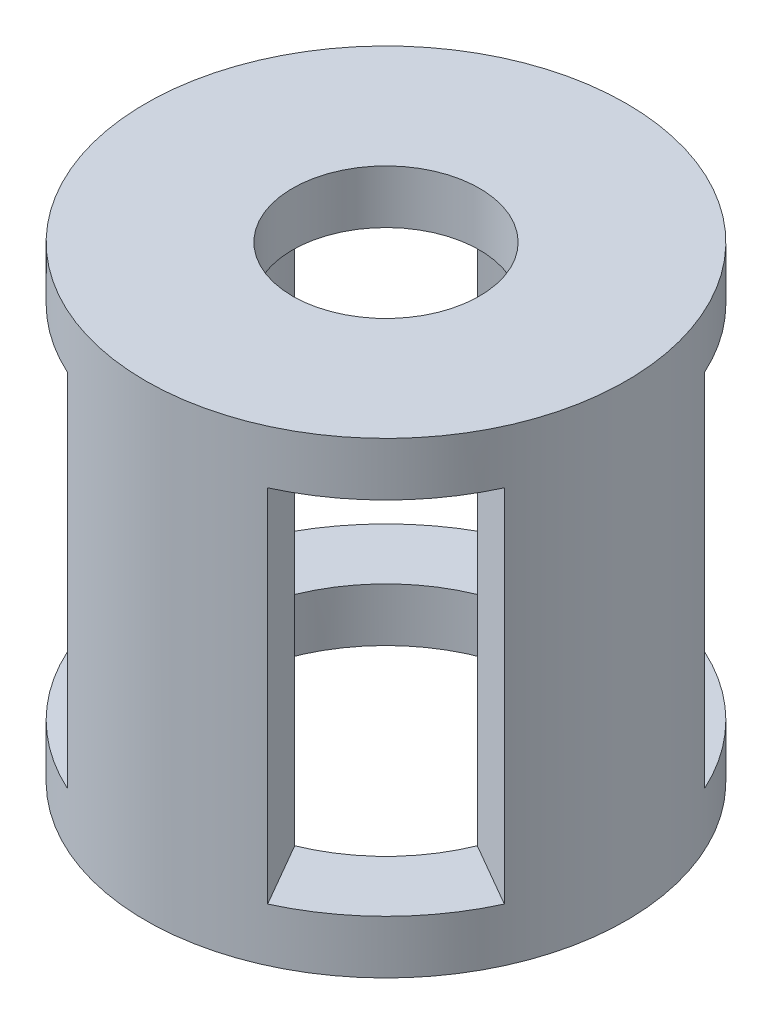
ISO-10303-21;
HEADER;
FILE_DESCRIPTION(('STEP AP214'),'2;1');
FILE_NAME('part.step','',(''),(''),'','','');
FILE_SCHEMA(('AUTOMOTIVE_DESIGN { 1 0 10303 214 1 1 1 1 }'));
ENDSEC;
DATA;
#1=APPLICATION_CONTEXT('core data for automotive mechanical design processes');
#2=APPLICATION_PROTOCOL_DEFINITION('international standard','automotive_design',2000,#1);
#3=PRODUCT_CONTEXT('',#1,'mechanical');
#4=PRODUCT('Part','Part','',(#3));
#5=PRODUCT_RELATED_PRODUCT_CATEGORY('part','',(#4));
#6=PRODUCT_DEFINITION_FORMATION('','',#4);
#7=PRODUCT_DEFINITION_CONTEXT('part definition',#1,'design');
#8=PRODUCT_DEFINITION('design','',#6,#7);
#9=PRODUCT_DEFINITION_SHAPE('','',#8);
#10=(LENGTH_UNIT() NAMED_UNIT(*) SI_UNIT(.MILLI.,.METRE.));
#11=(NAMED_UNIT(*) PLANE_ANGLE_UNIT() SI_UNIT($,.RADIAN.));
#12=(NAMED_UNIT(*) SI_UNIT($,.STERADIAN.) SOLID_ANGLE_UNIT());
#13=UNCERTAINTY_MEASURE_WITH_UNIT(LENGTH_MEASURE(1.E-05),#10,'distance_accuracy_value','');
#14=(GEOMETRIC_REPRESENTATION_CONTEXT(3) GLOBAL_UNCERTAINTY_ASSIGNED_CONTEXT((#13)) GLOBAL_UNIT_ASSIGNED_CONTEXT((#10,
#11,#12)) REPRESENTATION_CONTEXT('',''));
#15=CARTESIAN_POINT('',(0.,0.,0.));
#16=DIRECTION('',(0.,0.,1.));
#17=DIRECTION('',(1.,0.,0.));
#18=AXIS2_PLACEMENT_3D('',#15,#16,#17);
#19=CARTESIAN_POINT('',(4.73244738359085,-30.,11.5695264277128));
#20=DIRECTION('',(-0.866025403784438,0.,0.500000000000001));
#21=DIRECTION('',(0.500000000000001,0.,0.866025403784438));
#22=AXIS2_PLACEMENT_3D('',#19,#20,#21);
#23=PLANE('',#22);
#24=DIRECTION('',(0.500000000000001,0.,0.866025403784438));
#25=VECTOR('',#24,1.);
#26=CARTESIAN_POINT('',(4.73244738359085,-27.,11.5695264277128));
#27=LINE('',#26,#25);
#28=CARTESIAN_POINT('',(4.73244738359085,-27.,11.5695264277128));
#29=VERTEX_POINT('',#28);
#30=CARTESIAN_POINT('',(7.5,-27.,16.3630681719536));
#31=VERTEX_POINT('',#30);
#32=EDGE_CURVE('E48',#29,#31,#27,.T.);
#33=ORIENTED_EDGE('',*,*,#32,.F.);
#34=DIRECTION('',(0.,1.,0.));
#35=VECTOR('',#34,1.);
#36=CARTESIAN_POINT('',(4.73244738359085,-30.,11.5695264277128));
#37=LINE('',#36,#35);
#38=CARTESIAN_POINT('',(4.73244738359085,0.,11.5695264277128));
#39=VERTEX_POINT('',#38);
#40=EDGE_CURVE('E227',#29,#39,#37,.T.);
#41=ORIENTED_EDGE('',*,*,#40,.T.);
#42=DIRECTION('',(0.500000000000001,0.,0.866025403784438));
#43=VECTOR('',#42,1.);
#44=CARTESIAN_POINT('',(4.73244738359085,0.,11.5695264277128));
#45=LINE('',#44,#43);
#46=CARTESIAN_POINT('',(7.5,0.,16.3630681719536));
#47=VERTEX_POINT('',#46);
#48=EDGE_CURVE('E217',#39,#47,#45,.T.);
#49=ORIENTED_EDGE('',*,*,#48,.T.);
#50=DIRECTION('',(0.,1.,0.));
#51=VECTOR('',#50,1.);
#52=CARTESIAN_POINT('',(7.5,-30.,16.3630681719536));
#53=LINE('',#52,#51);
#54=EDGE_CURVE('E53',#31,#47,#53,.T.);
#55=ORIENTED_EDGE('',*,*,#54,.F.);
#56=EDGE_LOOP('',(#33,#41,#49,#55));
#57=FACE_BOUND('',#56,.T.);
#58=ADVANCED_FACE('F33',(#57),#23,.F.);
#59=CARTESIAN_POINT('',(-4.73244738359085,-30.,11.5695264277128));
#60=DIRECTION('',(0.866025403784438,0.,0.500000000000001));
#61=DIRECTION('',(0.500000000000001,0.,-0.866025403784438));
#62=AXIS2_PLACEMENT_3D('',#59,#60,#61);
#63=PLANE('',#62);
#64=DIRECTION('',(0.500000000000001,0.,-0.866025403784438));
#65=VECTOR('',#64,1.);
#66=CARTESIAN_POINT('',(-4.73244738359085,-27.,11.5695264277128));
#67=LINE('',#66,#65);
#68=CARTESIAN_POINT('',(-7.49999999999999,-27.,16.3630681719536));
#69=VERTEX_POINT('',#68);
#70=CARTESIAN_POINT('',(-4.73244738359085,-27.,11.5695264277128));
#71=VERTEX_POINT('',#70);
#72=EDGE_CURVE('E309',#69,#71,#67,.T.);
#73=ORIENTED_EDGE('',*,*,#72,.F.);
#74=DIRECTION('',(0.,1.,0.));
#75=VECTOR('',#74,1.);
#76=CARTESIAN_POINT('',(-7.49999999999999,-30.,16.3630681719536));
#77=LINE('',#76,#75);
#78=CARTESIAN_POINT('',(-7.5,0.,16.3630681719536));
#79=VERTEX_POINT('',#78);
#80=EDGE_CURVE('E224',#69,#79,#77,.T.);
#81=ORIENTED_EDGE('',*,*,#80,.T.);
#82=DIRECTION('',(0.500000000000001,0.,-0.866025403784438));
#83=VECTOR('',#82,1.);
#84=CARTESIAN_POINT('',(-4.73244738359085,0.,11.5695264277128));
#85=LINE('',#84,#83);
#86=CARTESIAN_POINT('',(-4.73244738359085,0.,11.5695264277128));
#87=VERTEX_POINT('',#86);
#88=EDGE_CURVE('E219',#79,#87,#85,.T.);
#89=ORIENTED_EDGE('',*,*,#88,.T.);
#90=DIRECTION('',(0.,1.,0.));
#91=VECTOR('',#90,1.);
#92=CARTESIAN_POINT('',(-4.73244738359085,-30.,11.5695264277128));
#93=LINE('',#92,#91);
#94=EDGE_CURVE('E222',#71,#87,#93,.T.);
#95=ORIENTED_EDGE('',*,*,#94,.F.);
#96=EDGE_LOOP('',(#73,#81,#89,#95));
#97=FACE_BOUND('',#96,.T.);
#98=ADVANCED_FACE('F315',(#97),#63,.F.);
#99=CARTESIAN_POINT('',(11.5695264277127,-30.,-4.7324473835909));
#100=DIRECTION('',(0.500000000000004,0.,0.866025403784436));
#101=DIRECTION('',(0.866025403784436,0.,-0.500000000000004));
#102=AXIS2_PLACEMENT_3D('',#99,#100,#101);
#103=PLANE('',#102);
#104=DIRECTION('',(0.866025403784436,0.,-0.500000000000004));
#105=VECTOR('',#104,1.);
#106=CARTESIAN_POINT('',(11.5695264277127,-27.,-4.7324473835909));
#107=LINE('',#106,#105);
#108=CARTESIAN_POINT('',(11.5695264277127,-27.,-4.7324473835909));
#109=VERTEX_POINT('',#108);
#110=CARTESIAN_POINT('',(16.3630681719535,-27.,-7.50000000000006));
#111=VERTEX_POINT('',#110);
#112=EDGE_CURVE('E307',#109,#111,#107,.T.);
#113=ORIENTED_EDGE('',*,*,#112,.F.);
#114=DIRECTION('',(0.,1.,0.));
#115=VECTOR('',#114,1.);
#116=CARTESIAN_POINT('',(11.5695264277127,-30.,-4.7324473835909));
#117=LINE('',#116,#115);
#118=CARTESIAN_POINT('',(11.5695264277127,0.,-4.7324473835909));
#119=VERTEX_POINT('',#118);
#120=EDGE_CURVE('E212',#109,#119,#117,.T.);
#121=ORIENTED_EDGE('',*,*,#120,.T.);
#122=DIRECTION('',(0.866025403784436,0.,-0.500000000000004));
#123=VECTOR('',#122,1.);
#124=CARTESIAN_POINT('',(11.5695264277127,0.,-4.7324473835909));
#125=LINE('',#124,#123);
#126=CARTESIAN_POINT('',(16.3630681719535,0.,-7.50000000000006));
#127=VERTEX_POINT('',#126);
#128=EDGE_CURVE('E200',#119,#127,#125,.T.);
#129=ORIENTED_EDGE('',*,*,#128,.T.);
#130=DIRECTION('',(0.,1.,0.));
#131=VECTOR('',#130,1.);
#132=CARTESIAN_POINT('',(16.3630681719535,-30.,-7.50000000000006));
#133=LINE('',#132,#131);
#134=EDGE_CURVE('E210',#111,#127,#133,.T.);
#135=ORIENTED_EDGE('',*,*,#134,.F.);
#136=EDGE_LOOP('',(#113,#121,#129,#135));
#137=FACE_BOUND('',#136,.T.);
#138=ADVANCED_FACE('F335',(#137),#103,.F.);
#139=CARTESIAN_POINT('',(11.5695264277128,-30.,4.73244738359081));
#140=DIRECTION('',(0.499999999999998,0.,-0.86602540378444));
#141=DIRECTION('',(-0.86602540378444,0.,-0.499999999999998));
#142=AXIS2_PLACEMENT_3D('',#139,#140,#141);
#143=PLANE('',#142);
#144=DIRECTION('',(-0.86602540378444,0.,-0.499999999999998));
#145=VECTOR('',#144,1.);
#146=CARTESIAN_POINT('',(11.5695264277128,-27.,4.73244738359081));
#147=LINE('',#146,#145);
#148=CARTESIAN_POINT('',(16.3630681719536,-27.,7.49999999999994));
#149=VERTEX_POINT('',#148);
#150=CARTESIAN_POINT('',(11.5695264277128,-27.,4.73244738359081));
#151=VERTEX_POINT('',#150);
#152=EDGE_CURVE('E283',#149,#151,#147,.T.);
#153=ORIENTED_EDGE('',*,*,#152,.F.);
#154=DIRECTION('',(0.,1.,0.));
#155=VECTOR('',#154,1.);
#156=CARTESIAN_POINT('',(16.3630681719536,-30.,7.49999999999994));
#157=LINE('',#156,#155);
#158=CARTESIAN_POINT('',(16.3630681719536,0.,7.49999999999994));
#159=VERTEX_POINT('',#158);
#160=EDGE_CURVE('E208',#149,#159,#157,.T.);
#161=ORIENTED_EDGE('',*,*,#160,.T.);
#162=DIRECTION('',(-0.86602540378444,0.,-0.499999999999998));
#163=VECTOR('',#162,1.);
#164=CARTESIAN_POINT('',(11.5695264277128,0.,4.73244738359081));
#165=LINE('',#164,#163);
#166=CARTESIAN_POINT('',(11.5695264277128,0.,4.73244738359081));
#167=VERTEX_POINT('',#166);
#168=EDGE_CURVE('E203',#159,#167,#165,.T.);
#169=ORIENTED_EDGE('',*,*,#168,.T.);
#170=DIRECTION('',(0.,1.,0.));
#171=VECTOR('',#170,1.);
#172=CARTESIAN_POINT('',(11.5695264277128,-30.,4.73244738359081));
#173=LINE('',#172,#171);
#174=EDGE_CURVE('E206',#151,#167,#173,.T.);
#175=ORIENTED_EDGE('',*,*,#174,.F.);
#176=EDGE_LOOP('',(#153,#161,#169,#175));
#177=FACE_BOUND('',#176,.T.);
#178=ADVANCED_FACE('F290',(#177),#143,.F.);
#179=CARTESIAN_POINT('',(-4.73244738359094,-30.,-11.5695264277127));
#180=DIRECTION('',(0.866025403784434,0.,-0.500000000000007));
#181=DIRECTION('',(-0.500000000000007,0.,-0.866025403784434));
#182=AXIS2_PLACEMENT_3D('',#179,#180,#181);
#183=PLANE('',#182);
#184=DIRECTION('',(-0.500000000000007,0.,-0.866025403784434));
#185=VECTOR('',#184,1.);
#186=CARTESIAN_POINT('',(-4.73244738359094,-27.,-11.5695264277127));
#187=LINE('',#186,#185);
#188=CARTESIAN_POINT('',(-4.73244738359094,-27.,-11.5695264277127));
#189=VERTEX_POINT('',#188);
#190=CARTESIAN_POINT('',(-7.50000000000012,-27.,-16.3630681719535));
#191=VERTEX_POINT('',#190);
#192=EDGE_CURVE('E304',#189,#191,#187,.T.);
#193=ORIENTED_EDGE('',*,*,#192,.F.);
#194=DIRECTION('',(0.,1.,0.));
#195=VECTOR('',#194,1.);
#196=CARTESIAN_POINT('',(-4.73244738359094,-30.,-11.5695264277127));
#197=LINE('',#196,#195);
#198=CARTESIAN_POINT('',(-4.73244738359094,0.,-11.5695264277127));
#199=VERTEX_POINT('',#198);
#200=EDGE_CURVE('E195',#189,#199,#197,.T.);
#201=ORIENTED_EDGE('',*,*,#200,.T.);
#202=DIRECTION('',(-0.500000000000007,0.,-0.866025403784435));
#203=VECTOR('',#202,1.);
#204=CARTESIAN_POINT('',(-4.73244738359094,0.,-11.5695264277127));
#205=LINE('',#204,#203);
#206=CARTESIAN_POINT('',(-7.50000000000012,0.,-16.3630681719535));
#207=VERTEX_POINT('',#206);
#208=EDGE_CURVE('E183',#199,#207,#205,.T.);
#209=ORIENTED_EDGE('',*,*,#208,.T.);
#210=DIRECTION('',(0.,1.,0.));
#211=VECTOR('',#210,1.);
#212=CARTESIAN_POINT('',(-7.50000000000012,-30.,-16.3630681719535));
#213=LINE('',#212,#211);
#214=EDGE_CURVE('E193',#191,#207,#213,.T.);
#215=ORIENTED_EDGE('',*,*,#214,.F.);
#216=EDGE_LOOP('',(#193,#201,#209,#215));
#217=FACE_BOUND('',#216,.T.);
#218=ADVANCED_FACE('F357',(#217),#183,.F.);
#219=CARTESIAN_POINT('',(4.73244738359077,-30.,-11.5695264277128));
#220=DIRECTION('',(-0.866025403784441,0.,-0.499999999999995));
#221=DIRECTION('',(-0.499999999999995,0.,0.866025403784441));
#222=AXIS2_PLACEMENT_3D('',#219,#220,#221);
#223=PLANE('',#222);
#224=DIRECTION('',(-0.499999999999995,0.,0.866025403784441));
#225=VECTOR('',#224,1.);
#226=CARTESIAN_POINT('',(4.73244738359077,-27.,-11.5695264277128));
#227=LINE('',#226,#225);
#228=CARTESIAN_POINT('',(7.49999999999988,-27.,-16.3630681719536));
#229=VERTEX_POINT('',#228);
#230=CARTESIAN_POINT('',(4.73244738359077,-27.,-11.5695264277128));
#231=VERTEX_POINT('',#230);
#232=EDGE_CURVE('E302',#229,#231,#227,.T.);
#233=ORIENTED_EDGE('',*,*,#232,.F.);
#234=DIRECTION('',(0.,1.,0.));
#235=VECTOR('',#234,1.);
#236=CARTESIAN_POINT('',(7.49999999999988,-30.,-16.3630681719536));
#237=LINE('',#236,#235);
#238=CARTESIAN_POINT('',(7.49999999999988,0.,-16.3630681719536));
#239=VERTEX_POINT('',#238);
#240=EDGE_CURVE('E191',#229,#239,#237,.T.);
#241=ORIENTED_EDGE('',*,*,#240,.T.);
#242=DIRECTION('',(-0.499999999999995,0.,0.866025403784441));
#243=VECTOR('',#242,1.);
#244=CARTESIAN_POINT('',(4.73244738359077,0.,-11.5695264277128));
#245=LINE('',#244,#243);
#246=CARTESIAN_POINT('',(4.73244738359077,0.,-11.5695264277128));
#247=VERTEX_POINT('',#246);
#248=EDGE_CURVE('E186',#239,#247,#245,.T.);
#249=ORIENTED_EDGE('',*,*,#248,.T.);
#250=DIRECTION('',(0.,1.,0.));
#251=VECTOR('',#250,1.);
#252=CARTESIAN_POINT('',(4.73244738359077,-30.,-11.5695264277128));
#253=LINE('',#252,#251);
#254=EDGE_CURVE('E189',#231,#247,#253,.T.);
#255=ORIENTED_EDGE('',*,*,#254,.F.);
#256=EDGE_LOOP('',(#233,#241,#249,#255));
#257=FACE_BOUND('',#256,.T.);
#258=ADVANCED_FACE('F349',(#257),#223,.F.);
#259=CARTESIAN_POINT('',(-11.5695264277127,-30.,4.73244738359097));
#260=DIRECTION('',(-0.50000000000001,0.,-0.866025403784433));
#261=DIRECTION('',(-0.866025403784433,0.,0.50000000000001));
#262=AXIS2_PLACEMENT_3D('',#259,#260,#261);
#263=PLANE('',#262);
#264=DIRECTION('',(-0.866025403784433,0.,0.50000000000001));
#265=VECTOR('',#264,1.);
#266=CARTESIAN_POINT('',(-11.5695264277127,-27.,4.73244738359097));
#267=LINE('',#266,#265);
#268=CARTESIAN_POINT('',(-11.5695264277127,-27.,4.73244738359097));
#269=VERTEX_POINT('',#268);
#270=CARTESIAN_POINT('',(-16.3630681719535,-27.,7.50000000000017));
#271=VERTEX_POINT('',#270);
#272=EDGE_CURVE('E151',#269,#271,#267,.T.);
#273=ORIENTED_EDGE('',*,*,#272,.F.);
#274=DIRECTION('',(0.,1.,0.));
#275=VECTOR('',#274,1.);
#276=CARTESIAN_POINT('',(-11.5695264277127,-30.,4.73244738359097));
#277=LINE('',#276,#275);
#278=CARTESIAN_POINT('',(-11.5695264277127,0.,4.73244738359097));
#279=VERTEX_POINT('',#278);
#280=EDGE_CURVE('E144',#269,#279,#277,.T.);
#281=ORIENTED_EDGE('',*,*,#280,.T.);
#282=DIRECTION('',(-0.866025403784433,0.,0.50000000000001));
#283=VECTOR('',#282,1.);
#284=CARTESIAN_POINT('',(-11.5695264277127,0.,4.73244738359097));
#285=LINE('',#284,#283);
#286=CARTESIAN_POINT('',(-16.3630681719535,0.,7.50000000000017));
#287=VERTEX_POINT('',#286);
#288=EDGE_CURVE('E148',#279,#287,#285,.T.);
#289=ORIENTED_EDGE('',*,*,#288,.T.);
#290=DIRECTION('',(0.,1.,0.));
#291=VECTOR('',#290,1.);
#292=CARTESIAN_POINT('',(-16.3630681719535,-30.,7.50000000000017));
#293=LINE('',#292,#291);
#294=EDGE_CURVE('E156',#271,#287,#293,.T.);
#295=ORIENTED_EDGE('',*,*,#294,.F.);
#296=EDGE_LOOP('',(#273,#281,#289,#295));
#297=FACE_BOUND('',#296,.T.);
#298=ADVANCED_FACE('F146',(#297),#263,.F.);
#299=CARTESIAN_POINT('',(-11.5695264277128,-30.,-4.73244738359074));
#300=DIRECTION('',(-0.499999999999992,0.,0.866025403784443));
#301=DIRECTION('',(0.866025403784443,0.,0.499999999999992));
#302=AXIS2_PLACEMENT_3D('',#299,#300,#301);
#303=PLANE('',#302);
#304=DIRECTION('',(0.866025403784443,0.,0.499999999999992));
#305=VECTOR('',#304,1.);
#306=CARTESIAN_POINT('',(-11.5695264277128,-27.,-4.73244738359074));
#307=LINE('',#306,#305);
#308=CARTESIAN_POINT('',(-16.3630681719537,-27.,-7.49999999999982));
#309=VERTEX_POINT('',#308);
#310=CARTESIAN_POINT('',(-11.5695264277128,-27.,-4.73244738359074));
#311=VERTEX_POINT('',#310);
#312=EDGE_CURVE('E11',#309,#311,#307,.T.);
#313=ORIENTED_EDGE('',*,*,#312,.F.);
#314=DIRECTION('',(0.,1.,0.));
#315=VECTOR('',#314,1.);
#316=CARTESIAN_POINT('',(-16.3630681719537,-30.,-7.49999999999982));
#317=LINE('',#316,#315);
#318=CARTESIAN_POINT('',(-16.3630681719537,0.,-7.49999999999982));
#319=VERTEX_POINT('',#318);
#320=EDGE_CURVE('E178',#309,#319,#317,.T.);
#321=ORIENTED_EDGE('',*,*,#320,.T.);
#322=DIRECTION('',(0.866025403784443,0.,0.499999999999992));
#323=VECTOR('',#322,1.);
#324=CARTESIAN_POINT('',(-11.5695264277128,0.,-4.73244738359074));
#325=LINE('',#324,#323);
#326=CARTESIAN_POINT('',(-11.5695264277128,0.,-4.73244738359074));
#327=VERTEX_POINT('',#326);
#328=EDGE_CURVE('E172',#319,#327,#325,.T.);
#329=ORIENTED_EDGE('',*,*,#328,.T.);
#330=DIRECTION('',(0.,1.,0.));
#331=VECTOR('',#330,1.);
#332=CARTESIAN_POINT('',(-11.5695264277128,-30.,-4.73244738359074));
#333=LINE('',#332,#331);
#334=EDGE_CURVE('E163',#311,#327,#333,.T.);
#335=ORIENTED_EDGE('',*,*,#334,.F.);
#336=EDGE_LOOP('',(#313,#321,#329,#335));
#337=FACE_BOUND('',#336,.T.);
#338=ADVANCED_FACE('F256',(#337),#303,.F.);
#339=CARTESIAN_POINT('',(0.,0.,0.));
#340=DIRECTION('',(0.,1.,0.));
#341=DIRECTION('',(0.,0.,1.));
#342=AXIS2_PLACEMENT_3D('',#339,#340,#341);
#343=PLANE('',#342);
#344=CARTESIAN_POINT('',(0.,0.,0.));
#345=DIRECTION('',(0.,1.,0.));
#346=DIRECTION('',(0.,0.,1.));
#347=AXIS2_PLACEMENT_3D('',#344,#345,#346);
#348=CIRCLE('',#347,7.);
#349=CARTESIAN_POINT('',(0.,0.,7.));
#350=VERTEX_POINT('',#349);
#351=EDGE_CURVE('E229',#350,#350,#348,.T.);
#352=ORIENTED_EDGE('',*,*,#351,.T.);
#353=EDGE_LOOP('',(#352));
#354=FACE_BOUND('',#353,.T.);
#355=ORIENTED_EDGE('',*,*,#288,.F.);
#356=CARTESIAN_POINT('',(0.,0.,0.));
#357=DIRECTION('',(0.,1.,0.));
#358=DIRECTION('',(0.,0.,-1.));
#359=AXIS2_PLACEMENT_3D('',#356,#357,#358);
#360=CIRCLE('',#359,12.5);
#361=EDGE_CURVE('E159',#327,#279,#360,.T.);
#362=ORIENTED_EDGE('',*,*,#361,.F.);
#363=ORIENTED_EDGE('',*,*,#328,.F.);
#364=CARTESIAN_POINT('',(0.,0.,0.));
#365=DIRECTION('',(0.,1.,0.));
#366=DIRECTION('',(0.,0.,1.));
#367=AXIS2_PLACEMENT_3D('',#364,#365,#366);
#368=CIRCLE('',#367,18.);
#369=EDGE_CURVE('E243',#207,#319,#368,.T.);
#370=ORIENTED_EDGE('',*,*,#369,.F.);
#371=ORIENTED_EDGE('',*,*,#208,.F.);
#372=CARTESIAN_POINT('',(0.,0.,0.));
#373=DIRECTION('',(0.,1.,0.));
#374=DIRECTION('',(0.,0.,-1.));
#375=AXIS2_PLACEMENT_3D('',#372,#373,#374);
#376=CIRCLE('',#375,12.5);
#377=EDGE_CURVE('E155',#247,#199,#376,.T.);
#378=ORIENTED_EDGE('',*,*,#377,.F.);
#379=ORIENTED_EDGE('',*,*,#248,.F.);
#380=EDGE_CURVE('E238',#127,#239,#368,.T.);
#381=ORIENTED_EDGE('',*,*,#380,.F.);
#382=ORIENTED_EDGE('',*,*,#128,.F.);
#383=CARTESIAN_POINT('',(0.,0.,0.));
#384=DIRECTION('',(0.,1.,0.));
#385=DIRECTION('',(0.,0.,-1.));
#386=AXIS2_PLACEMENT_3D('',#383,#384,#385);
#387=CIRCLE('',#386,12.5);
#388=EDGE_CURVE('E197',#167,#119,#387,.T.);
#389=ORIENTED_EDGE('',*,*,#388,.F.);
#390=ORIENTED_EDGE('',*,*,#168,.F.);
#391=EDGE_CURVE('E236',#47,#159,#368,.T.);
#392=ORIENTED_EDGE('',*,*,#391,.F.);
#393=ORIENTED_EDGE('',*,*,#48,.F.);
#394=CARTESIAN_POINT('',(0.,0.,0.));
#395=DIRECTION('',(0.,1.,0.));
#396=DIRECTION('',(0.,0.,-1.));
#397=AXIS2_PLACEMENT_3D('',#394,#395,#396);
#398=CIRCLE('',#397,12.5);
#399=EDGE_CURVE('E214',#87,#39,#398,.T.);
#400=ORIENTED_EDGE('',*,*,#399,.F.);
#401=ORIENTED_EDGE('',*,*,#88,.F.);
#402=EDGE_CURVE('E171',#287,#79,#368,.T.);
#403=ORIENTED_EDGE('',*,*,#402,.F.);
#404=EDGE_LOOP('',(#355,#362,#363,#370,#371,#378,#379,#381,#382,#389,#390,#392,#393,#400,#401,#403));
#405=FACE_BOUND('',#404,.T.);
#406=ADVANCED_FACE('F168',(#354,#405),#343,.F.);
#407=CARTESIAN_POINT('',(0.,4.,0.));
#408=DIRECTION('',(0.,1.,0.));
#409=DIRECTION('',(0.,0.,1.));
#410=AXIS2_PLACEMENT_3D('',#407,#408,#409);
#411=PLANE('',#410);
#412=CARTESIAN_POINT('',(0.,4.,0.));
#413=DIRECTION('',(0.,1.,0.));
#414=DIRECTION('',(0.,0.,1.));
#415=AXIS2_PLACEMENT_3D('',#412,#413,#414);
#416=CIRCLE('',#415,18.);
#417=CARTESIAN_POINT('',(0.,4.,18.));
#418=VERTEX_POINT('',#417);
#419=EDGE_CURVE('E41',#418,#418,#416,.T.);
#420=ORIENTED_EDGE('',*,*,#419,.T.);
#421=EDGE_LOOP('',(#420));
#422=FACE_BOUND('',#421,.T.);
#423=CARTESIAN_POINT('',(0.,4.,0.));
#424=DIRECTION('',(0.,1.,0.));
#425=DIRECTION('',(0.,0.,1.));
#426=AXIS2_PLACEMENT_3D('',#423,#424,#425);
#427=CIRCLE('',#426,7.);
#428=CARTESIAN_POINT('',(0.,4.,7.));
#429=VERTEX_POINT('',#428);
#430=EDGE_CURVE('E230',#429,#429,#427,.T.);
#431=ORIENTED_EDGE('',*,*,#430,.F.);
#432=EDGE_LOOP('',(#431));
#433=FACE_BOUND('',#432,.T.);
#434=ADVANCED_FACE('F318',(#422,#433),#411,.T.);
#435=CARTESIAN_POINT('',(0.,4.,0.));
#436=DIRECTION('',(0.,-1.,0.));
#437=DIRECTION('',(0.,0.,-1.));
#438=AXIS2_PLACEMENT_3D('',#435,#436,#437);
#439=CYLINDRICAL_SURFACE('',#438,18.);
#440=ORIENTED_EDGE('',*,*,#160,.F.);
#441=CARTESIAN_POINT('',(0.,-27.,0.));
#442=DIRECTION('',(0.,-1.,0.));
#443=DIRECTION('',(0.,0.,-1.));
#444=AXIS2_PLACEMENT_3D('',#441,#442,#443);
#445=CIRCLE('',#444,18.);
#446=EDGE_CURVE('E291',#149,#31,#445,.T.);
#447=ORIENTED_EDGE('',*,*,#446,.T.);
#448=ORIENTED_EDGE('',*,*,#54,.T.);
#449=ORIENTED_EDGE('',*,*,#391,.T.);
#450=EDGE_LOOP('',(#440,#447,#448,#449));
#451=FACE_BOUND('',#450,.T.);
#452=ORIENTED_EDGE('',*,*,#80,.F.);
#453=EDGE_CURVE('E274',#69,#271,#445,.T.);
#454=ORIENTED_EDGE('',*,*,#453,.T.);
#455=ORIENTED_EDGE('',*,*,#294,.T.);
#456=ORIENTED_EDGE('',*,*,#402,.T.);
#457=EDGE_LOOP('',(#452,#454,#455,#456));
#458=FACE_BOUND('',#457,.T.);
#459=ORIENTED_EDGE('',*,*,#320,.F.);
#460=EDGE_CURVE('E262',#309,#191,#445,.T.);
#461=ORIENTED_EDGE('',*,*,#460,.T.);
#462=ORIENTED_EDGE('',*,*,#214,.T.);
#463=ORIENTED_EDGE('',*,*,#369,.T.);
#464=EDGE_LOOP('',(#459,#461,#462,#463));
#465=FACE_BOUND('',#464,.T.);
#466=EDGE_CURVE('E275',#229,#111,#445,.T.);
#467=ORIENTED_EDGE('',*,*,#466,.T.);
#468=ORIENTED_EDGE('',*,*,#134,.T.);
#469=ORIENTED_EDGE('',*,*,#380,.T.);
#470=ORIENTED_EDGE('',*,*,#240,.F.);
#471=EDGE_LOOP('',(#467,#468,#469,#470));
#472=FACE_BOUND('',#471,.T.);
#473=CARTESIAN_POINT('',(0.,-31.,0.));
#474=DIRECTION('',(0.,-1.,0.));
#475=DIRECTION('',(0.,0.,-1.));
#476=AXIS2_PLACEMENT_3D('',#473,#474,#475);
#477=CIRCLE('',#476,18.);
#478=CARTESIAN_POINT('',(0.,-31.,-18.));
#479=VERTEX_POINT('',#478);
#480=EDGE_CURVE('E298',#479,#479,#477,.T.);
#481=ORIENTED_EDGE('',*,*,#480,.F.);
#482=EDGE_LOOP('',(#481));
#483=FACE_BOUND('',#482,.T.);
#484=ORIENTED_EDGE('',*,*,#419,.F.);
#485=EDGE_LOOP('',(#484));
#486=FACE_BOUND('',#485,.T.);
#487=ADVANCED_FACE('F35',(#451,#458,#465,#472,#483,#486),#439,.T.);
#488=CARTESIAN_POINT('',(0.,4.,0.));
#489=DIRECTION('',(0.,-1.,0.));
#490=DIRECTION('',(0.,0.,-1.));
#491=AXIS2_PLACEMENT_3D('',#488,#489,#490);
#492=CYLINDRICAL_SURFACE('',#491,7.);
#493=ORIENTED_EDGE('',*,*,#430,.T.);
#494=EDGE_LOOP('',(#493));
#495=FACE_BOUND('',#494,.T.);
#496=ORIENTED_EDGE('',*,*,#351,.F.);
#497=EDGE_LOOP('',(#496));
#498=FACE_BOUND('',#497,.T.);
#499=ADVANCED_FACE('F317',(#495,#498),#492,.F.);
#500=CARTESIAN_POINT('',(0.,-30.,0.));
#501=DIRECTION('',(0.,1.,0.));
#502=DIRECTION('',(0.,0.,1.));
#503=AXIS2_PLACEMENT_3D('',#500,#501,#502);
#504=CYLINDRICAL_SURFACE('',#503,12.5);
#505=CARTESIAN_POINT('',(0.,-27.,0.));
#506=DIRECTION('',(0.,-1.,0.));
#507=DIRECTION('',(0.,0.,-1.));
#508=AXIS2_PLACEMENT_3D('',#505,#506,#507);
#509=CIRCLE('',#508,12.5);
#510=EDGE_CURVE('E264',#71,#269,#509,.T.);
#511=ORIENTED_EDGE('',*,*,#510,.F.);
#512=ORIENTED_EDGE('',*,*,#94,.T.);
#513=ORIENTED_EDGE('',*,*,#399,.T.);
#514=ORIENTED_EDGE('',*,*,#40,.F.);
#515=EDGE_CURVE('E267',#151,#29,#509,.T.);
#516=ORIENTED_EDGE('',*,*,#515,.F.);
#517=ORIENTED_EDGE('',*,*,#174,.T.);
#518=ORIENTED_EDGE('',*,*,#388,.T.);
#519=ORIENTED_EDGE('',*,*,#120,.F.);
#520=EDGE_CURVE('E266',#231,#109,#509,.T.);
#521=ORIENTED_EDGE('',*,*,#520,.F.);
#522=ORIENTED_EDGE('',*,*,#254,.T.);
#523=ORIENTED_EDGE('',*,*,#377,.T.);
#524=ORIENTED_EDGE('',*,*,#200,.F.);
#525=EDGE_CURVE('E261',#311,#189,#509,.T.);
#526=ORIENTED_EDGE('',*,*,#525,.F.);
#527=ORIENTED_EDGE('',*,*,#334,.T.);
#528=ORIENTED_EDGE('',*,*,#361,.T.);
#529=ORIENTED_EDGE('',*,*,#280,.F.);
#530=EDGE_LOOP('',(#511,#512,#513,#514,#516,#517,#518,#519,#521,#522,#523,#524,#526,#527,#528,#529));
#531=FACE_BOUND('',#530,.T.);
#532=CARTESIAN_POINT('',(0.,-31.,0.));
#533=DIRECTION('',(0.,-1.,0.));
#534=DIRECTION('',(0.,0.,-1.));
#535=AXIS2_PLACEMENT_3D('',#532,#533,#534);
#536=CIRCLE('',#535,12.5);
#537=CARTESIAN_POINT('',(0.,-31.,-12.5));
#538=VERTEX_POINT('',#537);
#539=EDGE_CURVE('E293',#538,#538,#536,.T.);
#540=ORIENTED_EDGE('',*,*,#539,.T.);
#541=EDGE_LOOP('',(#540));
#542=FACE_BOUND('',#541,.T.);
#543=ADVANCED_FACE('F160',(#531,#542),#504,.F.);
#544=CARTESIAN_POINT('',(0.,-27.,0.));
#545=DIRECTION('',(0.,-1.,0.));
#546=DIRECTION('',(0.,0.,-1.));
#547=AXIS2_PLACEMENT_3D('',#544,#545,#546);
#548=PLANE('',#547);
#549=ORIENTED_EDGE('',*,*,#515,.T.);
#550=ORIENTED_EDGE('',*,*,#32,.T.);
#551=ORIENTED_EDGE('',*,*,#446,.F.);
#552=ORIENTED_EDGE('',*,*,#152,.T.);
#553=EDGE_LOOP('',(#549,#550,#551,#552));
#554=FACE_BOUND('',#553,.T.);
#555=ADVANCED_FACE('F280',(#554),#548,.F.);
#556=ORIENTED_EDGE('',*,*,#453,.F.);
#557=ORIENTED_EDGE('',*,*,#72,.T.);
#558=ORIENTED_EDGE('',*,*,#510,.T.);
#559=ORIENTED_EDGE('',*,*,#272,.T.);
#560=EDGE_LOOP('',(#556,#557,#558,#559));
#561=FACE_BOUND('',#560,.T.);
#562=ADVANCED_FACE('F313',(#561),#548,.F.);
#563=ORIENTED_EDGE('',*,*,#520,.T.);
#564=ORIENTED_EDGE('',*,*,#112,.T.);
#565=ORIENTED_EDGE('',*,*,#466,.F.);
#566=ORIENTED_EDGE('',*,*,#232,.T.);
#567=EDGE_LOOP('',(#563,#564,#565,#566));
#568=FACE_BOUND('',#567,.T.);
#569=ADVANCED_FACE('F373',(#568),#548,.F.);
#570=ORIENTED_EDGE('',*,*,#525,.T.);
#571=ORIENTED_EDGE('',*,*,#192,.T.);
#572=ORIENTED_EDGE('',*,*,#460,.F.);
#573=ORIENTED_EDGE('',*,*,#312,.T.);
#574=EDGE_LOOP('',(#570,#571,#572,#573));
#575=FACE_BOUND('',#574,.T.);
#576=ADVANCED_FACE('F259',(#575),#548,.F.);
#577=CARTESIAN_POINT('',(0.,-31.,0.));
#578=DIRECTION('',(0.,-1.,0.));
#579=DIRECTION('',(0.,0.,-1.));
#580=AXIS2_PLACEMENT_3D('',#577,#578,#579);
#581=PLANE('',#580);
#582=ORIENTED_EDGE('',*,*,#480,.T.);
#583=EDGE_LOOP('',(#582));
#584=FACE_BOUND('',#583,.T.);
#585=ORIENTED_EDGE('',*,*,#539,.F.);
#586=EDGE_LOOP('',(#585));
#587=FACE_BOUND('',#586,.T.);
#588=ADVANCED_FACE('F352',(#584,#587),#581,.T.);
#589=CLOSED_SHELL('',(#58,#98,#138,#178,#218,#258,#298,#338,#406,#434,#487,#499,#543,#555,#562,
#569,#576,#588));
#590=MANIFOLD_SOLID_BREP('B2',#589);
#591=ADVANCED_BREP_SHAPE_REPRESENTATION('',(#18,#590),#14);
#592=SHAPE_DEFINITION_REPRESENTATION(#9,#591);
ENDSEC;
END-ISO-10303-21;
